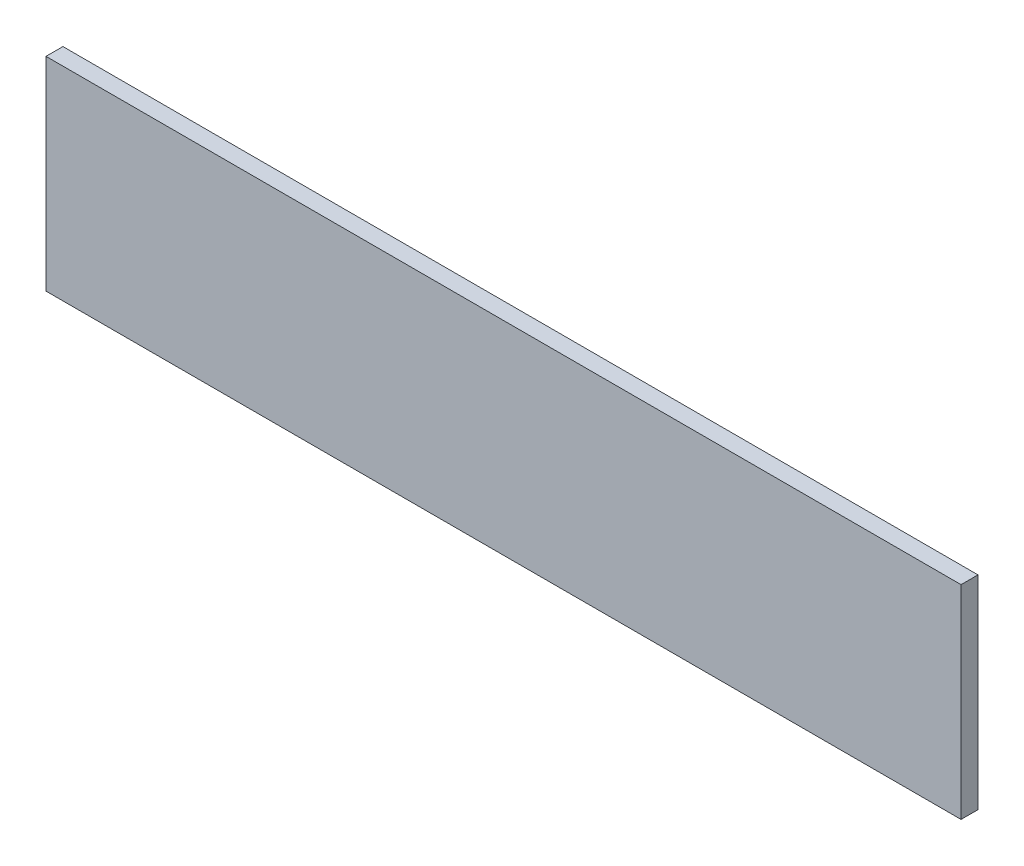
ISO-10303-21;
HEADER;
FILE_DESCRIPTION(('STEP AP214'),'2;1');
FILE_NAME('part.step','',(''),(''),'','','');
FILE_SCHEMA(('AUTOMOTIVE_DESIGN { 1 0 10303 214 1 1 1 1 }'));
ENDSEC;
DATA;
#1=APPLICATION_CONTEXT('core data for automotive mechanical design processes');
#2=APPLICATION_PROTOCOL_DEFINITION('international standard','automotive_design',2000,#1);
#3=PRODUCT_CONTEXT('',#1,'mechanical');
#4=PRODUCT('Part','Part','',(#3));
#5=PRODUCT_RELATED_PRODUCT_CATEGORY('part','',(#4));
#6=PRODUCT_DEFINITION_FORMATION('','',#4);
#7=PRODUCT_DEFINITION_CONTEXT('part definition',#1,'design');
#8=PRODUCT_DEFINITION('design','',#6,#7);
#9=PRODUCT_DEFINITION_SHAPE('','',#8);
#10=(LENGTH_UNIT() NAMED_UNIT(*) SI_UNIT(.MILLI.,.METRE.));
#11=(NAMED_UNIT(*) PLANE_ANGLE_UNIT() SI_UNIT($,.RADIAN.));
#12=(NAMED_UNIT(*) SI_UNIT($,.STERADIAN.) SOLID_ANGLE_UNIT());
#13=UNCERTAINTY_MEASURE_WITH_UNIT(LENGTH_MEASURE(1.E-05),#10,'distance_accuracy_value','');
#14=(GEOMETRIC_REPRESENTATION_CONTEXT(3) GLOBAL_UNCERTAINTY_ASSIGNED_CONTEXT((#13)) GLOBAL_UNIT_ASSIGNED_CONTEXT((#10,
#11,#12)) REPRESENTATION_CONTEXT('',''));
#15=CARTESIAN_POINT('',(0.,0.,0.));
#16=DIRECTION('',(0.,0.,1.));
#17=DIRECTION('',(1.,0.,0.));
#18=AXIS2_PLACEMENT_3D('',#15,#16,#17);
#19=CARTESIAN_POINT('',(342.9,76.2,12.7));
#20=DIRECTION('',(-1.,0.,0.));
#21=DIRECTION('',(0.,-1.,0.));
#22=AXIS2_PLACEMENT_3D('',#19,#20,#21);
#23=PLANE('',#22);
#24=DIRECTION('',(0.,1.,0.));
#25=VECTOR('',#24,1.);
#26=CARTESIAN_POINT('',(342.9,76.2,0.));
#27=LINE('',#26,#25);
#28=CARTESIAN_POINT('',(342.9,-76.2,0.));
#29=VERTEX_POINT('',#28);
#30=CARTESIAN_POINT('',(342.9,76.2,0.));
#31=VERTEX_POINT('',#30);
#32=EDGE_CURVE('E107',#29,#31,#27,.T.);
#33=ORIENTED_EDGE('',*,*,#32,.T.);
#34=DIRECTION('',(0.,0.,-1.));
#35=VECTOR('',#34,1.);
#36=CARTESIAN_POINT('',(342.9,76.2,12.7));
#37=LINE('',#36,#35);
#38=CARTESIAN_POINT('',(342.9,76.2,12.7));
#39=VERTEX_POINT('',#38);
#40=EDGE_CURVE('E11',#39,#31,#37,.T.);
#41=ORIENTED_EDGE('',*,*,#40,.F.);
#42=DIRECTION('',(0.,1.,0.));
#43=VECTOR('',#42,1.);
#44=CARTESIAN_POINT('',(342.9,76.2,12.7));
#45=LINE('',#44,#43);
#46=CARTESIAN_POINT('',(342.9,-76.2,12.7));
#47=VERTEX_POINT('',#46);
#48=EDGE_CURVE('E91',#47,#39,#45,.T.);
#49=ORIENTED_EDGE('',*,*,#48,.F.);
#50=DIRECTION('',(0.,0.,-1.));
#51=VECTOR('',#50,1.);
#52=CARTESIAN_POINT('',(342.9,-76.2,12.7));
#53=LINE('',#52,#51);
#54=EDGE_CURVE('E103',#47,#29,#53,.T.);
#55=ORIENTED_EDGE('',*,*,#54,.T.);
#56=EDGE_LOOP('',(#33,#41,#49,#55));
#57=FACE_BOUND('',#56,.T.);
#58=ADVANCED_FACE('F39',(#57),#23,.F.);
#59=CARTESIAN_POINT('',(-342.9,76.2,12.7));
#60=DIRECTION('',(0.,-1.,0.));
#61=DIRECTION('',(0.,0.,-1.));
#62=AXIS2_PLACEMENT_3D('',#59,#60,#61);
#63=PLANE('',#62);
#64=DIRECTION('',(-1.,0.,0.));
#65=VECTOR('',#64,1.);
#66=CARTESIAN_POINT('',(-342.9,76.2,0.));
#67=LINE('',#66,#65);
#68=CARTESIAN_POINT('',(-342.9,76.2,0.));
#69=VERTEX_POINT('',#68);
#70=EDGE_CURVE('E96',#31,#69,#67,.T.);
#71=ORIENTED_EDGE('',*,*,#70,.T.);
#72=DIRECTION('',(0.,0.,-1.));
#73=VECTOR('',#72,1.);
#74=CARTESIAN_POINT('',(-342.9,76.2,12.7));
#75=LINE('',#74,#73);
#76=CARTESIAN_POINT('',(-342.9,76.2,12.7));
#77=VERTEX_POINT('',#76);
#78=EDGE_CURVE('E48',#77,#69,#75,.T.);
#79=ORIENTED_EDGE('',*,*,#78,.F.);
#80=DIRECTION('',(-1.,0.,0.));
#81=VECTOR('',#80,1.);
#82=CARTESIAN_POINT('',(-342.9,76.2,12.7));
#83=LINE('',#82,#81);
#84=EDGE_CURVE('E86',#39,#77,#83,.T.);
#85=ORIENTED_EDGE('',*,*,#84,.F.);
#86=ORIENTED_EDGE('',*,*,#40,.T.);
#87=EDGE_LOOP('',(#71,#79,#85,#86));
#88=FACE_BOUND('',#87,.T.);
#89=ADVANCED_FACE('F95',(#88),#63,.F.);
#90=CARTESIAN_POINT('',(-342.9,76.2,12.7));
#91=DIRECTION('',(1.,0.,0.));
#92=DIRECTION('',(0.,0.,-1.));
#93=AXIS2_PLACEMENT_3D('',#90,#91,#92);
#94=PLANE('',#93);
#95=DIRECTION('',(0.,-1.,0.));
#96=VECTOR('',#95,1.);
#97=CARTESIAN_POINT('',(-342.9,76.2,0.));
#98=LINE('',#97,#96);
#99=CARTESIAN_POINT('',(-342.9,-76.2,0.));
#100=VERTEX_POINT('',#99);
#101=EDGE_CURVE('E73',#69,#100,#98,.T.);
#102=ORIENTED_EDGE('',*,*,#101,.T.);
#103=DIRECTION('',(0.,0.,-1.));
#104=VECTOR('',#103,1.);
#105=CARTESIAN_POINT('',(-342.9,-76.2,12.7));
#106=LINE('',#105,#104);
#107=CARTESIAN_POINT('',(-342.9,-76.2,12.7));
#108=VERTEX_POINT('',#107);
#109=EDGE_CURVE('E98',#108,#100,#106,.T.);
#110=ORIENTED_EDGE('',*,*,#109,.F.);
#111=DIRECTION('',(0.,-1.,0.));
#112=VECTOR('',#111,1.);
#113=CARTESIAN_POINT('',(-342.9,76.2,12.7));
#114=LINE('',#113,#112);
#115=EDGE_CURVE('E89',#77,#108,#114,.T.);
#116=ORIENTED_EDGE('',*,*,#115,.F.);
#117=ORIENTED_EDGE('',*,*,#78,.T.);
#118=EDGE_LOOP('',(#102,#110,#116,#117));
#119=FACE_BOUND('',#118,.T.);
#120=ADVANCED_FACE('F99',(#119),#94,.F.);
#121=CARTESIAN_POINT('',(-342.9,-76.2,12.7));
#122=DIRECTION('',(0.,1.,0.));
#123=DIRECTION('',(0.,0.,1.));
#124=AXIS2_PLACEMENT_3D('',#121,#122,#123);
#125=PLANE('',#124);
#126=DIRECTION('',(1.,0.,0.));
#127=VECTOR('',#126,1.);
#128=CARTESIAN_POINT('',(-342.9,-76.2,0.));
#129=LINE('',#128,#127);
#130=EDGE_CURVE('E79',#100,#29,#129,.T.);
#131=ORIENTED_EDGE('',*,*,#130,.T.);
#132=ORIENTED_EDGE('',*,*,#54,.F.);
#133=DIRECTION('',(1.,0.,0.));
#134=VECTOR('',#133,1.);
#135=CARTESIAN_POINT('',(-342.9,-76.2,12.7));
#136=LINE('',#135,#134);
#137=EDGE_CURVE('E56',#108,#47,#136,.T.);
#138=ORIENTED_EDGE('',*,*,#137,.F.);
#139=ORIENTED_EDGE('',*,*,#109,.T.);
#140=EDGE_LOOP('',(#131,#132,#138,#139));
#141=FACE_BOUND('',#140,.T.);
#142=ADVANCED_FACE('F120',(#141),#125,.F.);
#143=CARTESIAN_POINT('',(0.,0.,12.7));
#144=DIRECTION('',(0.,0.,1.));
#145=DIRECTION('',(1.,0.,0.));
#146=AXIS2_PLACEMENT_3D('',#143,#144,#145);
#147=PLANE('',#146);
#148=ORIENTED_EDGE('',*,*,#48,.T.);
#149=ORIENTED_EDGE('',*,*,#84,.T.);
#150=ORIENTED_EDGE('',*,*,#115,.T.);
#151=ORIENTED_EDGE('',*,*,#137,.T.);
#152=EDGE_LOOP('',(#148,#149,#150,#151));
#153=FACE_BOUND('',#152,.T.);
#154=ADVANCED_FACE('F87',(#153),#147,.T.);
#155=CARTESIAN_POINT('',(0.,0.,0.));
#156=DIRECTION('',(0.,0.,1.));
#157=DIRECTION('',(1.,0.,0.));
#158=AXIS2_PLACEMENT_3D('',#155,#156,#157);
#159=PLANE('',#158);
#160=ORIENTED_EDGE('',*,*,#32,.F.);
#161=ORIENTED_EDGE('',*,*,#130,.F.);
#162=ORIENTED_EDGE('',*,*,#101,.F.);
#163=ORIENTED_EDGE('',*,*,#70,.F.);
#164=EDGE_LOOP('',(#160,#161,#162,#163));
#165=FACE_BOUND('',#164,.T.);
#166=ADVANCED_FACE('F123',(#165),#159,.F.);
#167=CLOSED_SHELL('',(#58,#89,#120,#142,#154,#166));
#168=MANIFOLD_SOLID_BREP('B2',#167);
#169=ADVANCED_BREP_SHAPE_REPRESENTATION('',(#18,#168),#14);
#170=SHAPE_DEFINITION_REPRESENTATION(#9,#169);
ENDSEC;
END-ISO-10303-21;
